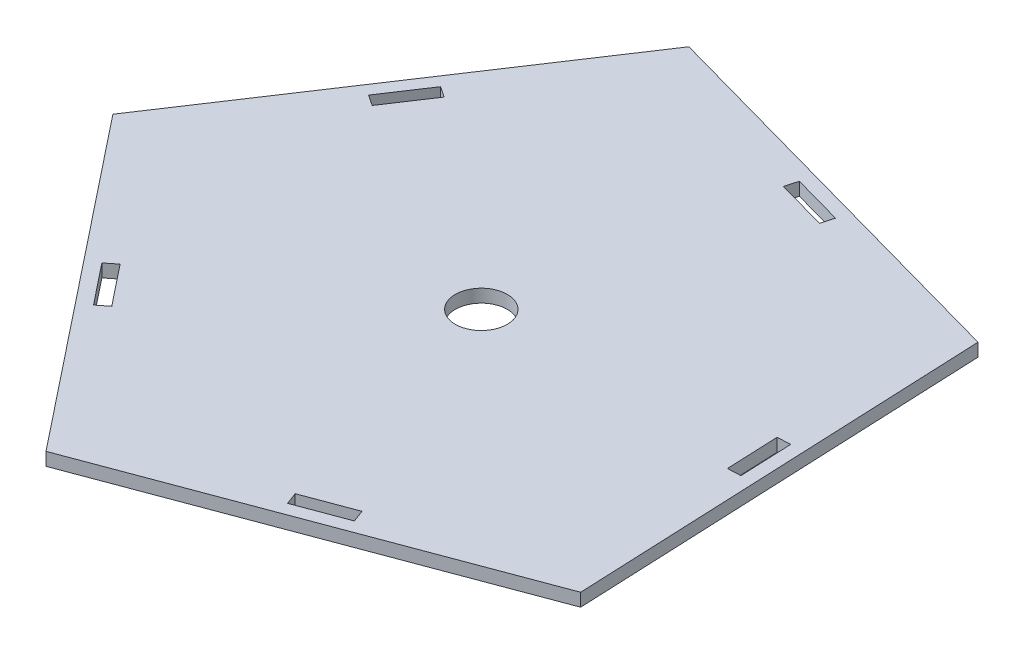
ISO-10303-21;
HEADER;
FILE_DESCRIPTION(('STEP AP214'),'2;1');
FILE_NAME('part.step','',(''),(''),'','','');
FILE_SCHEMA(('AUTOMOTIVE_DESIGN { 1 0 10303 214 1 1 1 1 }'));
ENDSEC;
DATA;
#1=APPLICATION_CONTEXT('core data for automotive mechanical design processes');
#2=APPLICATION_PROTOCOL_DEFINITION('international standard','automotive_design',2000,#1);
#3=PRODUCT_CONTEXT('',#1,'mechanical');
#4=PRODUCT('Part','Part','',(#3));
#5=PRODUCT_RELATED_PRODUCT_CATEGORY('part','',(#4));
#6=PRODUCT_DEFINITION_FORMATION('','',#4);
#7=PRODUCT_DEFINITION_CONTEXT('part definition',#1,'design');
#8=PRODUCT_DEFINITION('design','',#6,#7);
#9=PRODUCT_DEFINITION_SHAPE('','',#8);
#10=(LENGTH_UNIT() NAMED_UNIT(*) SI_UNIT(.MILLI.,.METRE.));
#11=(NAMED_UNIT(*) PLANE_ANGLE_UNIT() SI_UNIT($,.RADIAN.));
#12=(NAMED_UNIT(*) SI_UNIT($,.STERADIAN.) SOLID_ANGLE_UNIT());
#13=UNCERTAINTY_MEASURE_WITH_UNIT(LENGTH_MEASURE(1.E-05),#10,'distance_accuracy_value','');
#14=(GEOMETRIC_REPRESENTATION_CONTEXT(3) GLOBAL_UNCERTAINTY_ASSIGNED_CONTEXT((#13)) GLOBAL_UNIT_ASSIGNED_CONTEXT((#10,
#11,#12)) REPRESENTATION_CONTEXT('',''));
#15=CARTESIAN_POINT('',(0.,0.,0.));
#16=DIRECTION('',(0.,0.,1.));
#17=DIRECTION('',(1.,0.,0.));
#18=AXIS2_PLACEMENT_3D('',#15,#16,#17);
#19=CARTESIAN_POINT('',(-211.249631121891,6.35,103.874565796183));
#20=DIRECTION('',(-0.349646320054461,0.,-0.936881769954125));
#21=DIRECTION('',(-0.936881769954125,0.,0.349646320054461));
#22=AXIS2_PLACEMENT_3D('',#19,#20,#21);
#23=PLANE('',#22);
#24=DIRECTION('',(0.936881769954125,0.,-0.349646320054461));
#25=VECTOR('',#24,1.);
#26=CARTESIAN_POINT('',(-211.249631121891,0.,103.874565796183));
#27=LINE('',#26,#25);
#28=CARTESIAN_POINT('',(-211.249631121891,0.,103.874565796183));
#29=VERTEX_POINT('',#28);
#30=CARTESIAN_POINT('',(-20.8752554672127,0.,32.8264335611163));
#31=VERTEX_POINT('',#30);
#32=EDGE_CURVE('E238',#29,#31,#27,.T.);
#33=ORIENTED_EDGE('',*,*,#32,.T.);
#34=DIRECTION('',(0.,-1.,0.));
#35=VECTOR('',#34,1.);
#36=CARTESIAN_POINT('',(-20.8752554672127,6.35,32.8264335611163));
#37=LINE('',#36,#35);
#38=CARTESIAN_POINT('',(-20.8752554672127,6.35,32.8264335611163));
#39=VERTEX_POINT('',#38);
#40=EDGE_CURVE('E11',#39,#31,#37,.T.);
#41=ORIENTED_EDGE('',*,*,#40,.F.);
#42=DIRECTION('',(0.936881769954125,0.,-0.349646320054461));
#43=VECTOR('',#42,1.);
#44=CARTESIAN_POINT('',(-211.249631121891,6.35,103.874565796183));
#45=LINE('',#44,#43);
#46=CARTESIAN_POINT('',(-211.249631121891,6.35,103.874565796183));
#47=VERTEX_POINT('',#46);
#48=EDGE_CURVE('E368',#47,#39,#45,.T.);
#49=ORIENTED_EDGE('',*,*,#48,.F.);
#50=DIRECTION('',(0.,-1.,0.));
#51=VECTOR('',#50,1.);
#52=CARTESIAN_POINT('',(-211.249631121891,6.35,103.874565796183));
#53=LINE('',#52,#51);
#54=EDGE_CURVE('E380',#47,#29,#53,.T.);
#55=ORIENTED_EDGE('',*,*,#54,.T.);
#56=EDGE_LOOP('',(#33,#41,#49,#55));
#57=FACE_BOUND('',#56,.T.);
#58=ADVANCED_FACE('F32',(#57),#23,.F.);
#59=CARTESIAN_POINT('',(-20.8752554672127,6.35,32.8264335611163));
#60=DIRECTION('',(-0.999074167230498,0.,0.0430210224505114));
#61=DIRECTION('',(0.0430210224505114,0.,0.999074167230498));
#62=AXIS2_PLACEMENT_3D('',#59,#60,#61);
#63=PLANE('',#62);
#64=DIRECTION('',(-0.0430210224505114,0.,-0.999074167230498));
#65=VECTOR('',#64,1.);
#66=CARTESIAN_POINT('',(-20.8752554672127,0.,32.8264335611163));
#67=LINE('',#66,#65);
#68=CARTESIAN_POINT('',(-29.6171272291566,0.,-170.185437220121));
#69=VERTEX_POINT('',#68);
#70=EDGE_CURVE('E383',#31,#69,#67,.T.);
#71=ORIENTED_EDGE('',*,*,#70,.T.);
#72=DIRECTION('',(0.,-1.,0.));
#73=VECTOR('',#72,1.);
#74=CARTESIAN_POINT('',(-29.6171272291566,6.35,-170.185437220121));
#75=LINE('',#74,#73);
#76=CARTESIAN_POINT('',(-29.6171272291566,6.35,-170.185437220121));
#77=VERTEX_POINT('',#76);
#78=EDGE_CURVE('E39',#77,#69,#75,.T.);
#79=ORIENTED_EDGE('',*,*,#78,.F.);
#80=DIRECTION('',(-0.0430210224505114,0.,-0.999074167230498));
#81=VECTOR('',#80,1.);
#82=CARTESIAN_POINT('',(-20.8752554672127,6.35,32.8264335611163));
#83=LINE('',#82,#81);
#84=EDGE_CURVE('E371',#39,#77,#83,.T.);
#85=ORIENTED_EDGE('',*,*,#84,.F.);
#86=ORIENTED_EDGE('',*,*,#40,.T.);
#87=EDGE_LOOP('',(#71,#79,#85,#86));
#88=FACE_BOUND('',#87,.T.);
#89=ADVANCED_FACE('F421',(#88),#63,.F.);
#90=CARTESIAN_POINT('',(-29.6171272291566,6.35,-170.185437220121));
#91=DIRECTION('',(-0.267815472575983,0.,0.963470224059313));
#92=DIRECTION('',(0.963470224059313,0.,0.267815472575983));
#93=AXIS2_PLACEMENT_3D('',#90,#91,#92);
#94=PLANE('',#93);
#95=DIRECTION('',(-0.963470224059313,0.,-0.267815472575983));
#96=VECTOR('',#95,1.);
#97=CARTESIAN_POINT('',(-29.6171272291566,0.,-170.185437220121));
#98=LINE('',#97,#96);
#99=CARTESIAN_POINT('',(-225.394276758009,0.,-224.605541247561));
#100=VERTEX_POINT('',#99);
#101=EDGE_CURVE('E385',#69,#100,#98,.T.);
#102=ORIENTED_EDGE('',*,*,#101,.T.);
#103=DIRECTION('',(0.,-1.,0.));
#104=VECTOR('',#103,1.);
#105=CARTESIAN_POINT('',(-225.394276758009,6.35,-224.605541247561));
#106=LINE('',#105,#104);
#107=CARTESIAN_POINT('',(-225.394276758009,6.35,-224.605541247561));
#108=VERTEX_POINT('',#107);
#109=EDGE_CURVE('E395',#108,#100,#106,.T.);
#110=ORIENTED_EDGE('',*,*,#109,.F.);
#111=DIRECTION('',(-0.963470224059313,0.,-0.267815472575983));
#112=VECTOR('',#111,1.);
#113=CARTESIAN_POINT('',(-29.6171272291566,6.35,-170.185437220121));
#114=LINE('',#113,#112);
#115=EDGE_CURVE('E374',#77,#108,#114,.T.);
#116=ORIENTED_EDGE('',*,*,#115,.F.);
#117=ORIENTED_EDGE('',*,*,#78,.T.);
#118=EDGE_LOOP('',(#102,#110,#116,#117));
#119=FACE_BOUND('',#118,.T.);
#120=ADVANCED_FACE('F402',(#119),#94,.F.);
#121=CARTESIAN_POINT('',(-225.394276758009,6.35,-224.605541247561));
#122=DIRECTION('',(0.833555102465425,0.,0.55243632316662));
#123=DIRECTION('',(0.552436323166621,0.,-0.833555102465425));
#124=AXIS2_PLACEMENT_3D('',#121,#122,#123);
#125=PLANE('',#124);
#126=DIRECTION('',(-0.55243632316662,0.,0.833555102465425));
#127=VECTOR('',#126,1.);
#128=CARTESIAN_POINT('',(-225.394276758009,0.,-224.605541247561));
#129=LINE('',#128,#127);
#130=CARTESIAN_POINT('',(-337.649337625466,0.,-55.2271444265862));
#131=VERTEX_POINT('',#130);
#132=EDGE_CURVE('E387',#100,#131,#129,.T.);
#133=ORIENTED_EDGE('',*,*,#132,.T.);
#134=DIRECTION('',(0.,-1.,0.));
#135=VECTOR('',#134,1.);
#136=CARTESIAN_POINT('',(-337.649337625466,6.35,-55.2271444265862));
#137=LINE('',#136,#135);
#138=CARTESIAN_POINT('',(-337.649337625466,6.35,-55.2271444265862));
#139=VERTEX_POINT('',#138);
#140=EDGE_CURVE('E392',#139,#131,#137,.T.);
#141=ORIENTED_EDGE('',*,*,#140,.F.);
#142=DIRECTION('',(-0.55243632316662,0.,0.833555102465425));
#143=VECTOR('',#142,1.);
#144=CARTESIAN_POINT('',(-225.394276758009,6.35,-224.605541247561));
#145=LINE('',#144,#143);
#146=EDGE_CURVE('E376',#108,#139,#145,.T.);
#147=ORIENTED_EDGE('',*,*,#146,.F.);
#148=ORIENTED_EDGE('',*,*,#109,.T.);
#149=EDGE_LOOP('',(#133,#141,#147,#148));
#150=FACE_BOUND('',#149,.T.);
#151=ADVANCED_FACE('F411',(#150),#125,.F.);
#152=CARTESIAN_POINT('',(-337.649337625466,6.35,-55.2271444265862));
#153=DIRECTION('',(0.782980857395517,0.,-0.62204579972232));
#154=DIRECTION('',(-0.62204579972232,0.,-0.782980857395517));
#155=AXIS2_PLACEMENT_3D('',#152,#153,#154);
#156=PLANE('',#155);
#157=DIRECTION('',(0.622045799722321,0.,0.782980857395517));
#158=VECTOR('',#157,1.);
#159=CARTESIAN_POINT('',(-337.649337625466,0.,-55.2271444265862));
#160=LINE('',#159,#158);
#161=EDGE_CURVE('E372',#131,#29,#160,.T.);
#162=ORIENTED_EDGE('',*,*,#161,.T.);
#163=ORIENTED_EDGE('',*,*,#54,.F.);
#164=DIRECTION('',(0.622045799722321,0.,0.782980857395517));
#165=VECTOR('',#164,1.);
#166=CARTESIAN_POINT('',(-337.649337625466,6.35,-55.2271444265862));
#167=LINE('',#166,#165);
#168=EDGE_CURVE('E378',#139,#47,#167,.T.);
#169=ORIENTED_EDGE('',*,*,#168,.F.);
#170=ORIENTED_EDGE('',*,*,#140,.T.);
#171=EDGE_LOOP('',(#162,#163,#169,#170));
#172=FACE_BOUND('',#171,.T.);
#173=ADVANCED_FACE('F415',(#172),#156,.F.);
#174=CARTESIAN_POINT('',(0.,6.35,0.));
#175=DIRECTION('',(0.,1.,0.));
#176=DIRECTION('',(0.,0.,1.));
#177=AXIS2_PLACEMENT_3D('',#174,#175,#176);
#178=PLANE('',#177);
#179=CARTESIAN_POINT('',(-164.957125640347,6.35,-62.6634247073937));
#180=DIRECTION('',(0.,1.,0.));
#181=DIRECTION('',(0.,0.,1.));
#182=AXIS2_PLACEMENT_3D('',#179,#180,#181);
#183=CIRCLE('',#182,12.7);
#184=CARTESIAN_POINT('',(-164.957125640347,6.35,-49.9634247073937));
#185=VERTEX_POINT('',#184);
#186=EDGE_CURVE('E225',#185,#185,#183,.T.);
#187=ORIENTED_EDGE('',*,*,#186,.F.);
#188=EDGE_LOOP('',(#187));
#189=FACE_BOUND('',#188,.T.);
#190=DIRECTION('',(0.349646320054462,0.,0.936881769954124));
#191=VECTOR('',#190,1.);
#192=CARTESIAN_POINT('',(-132.401350037661,6.35,60.8926094649238));
#193=LINE('',#192,#191);
#194=CARTESIAN_POINT('',(-132.401350037661,6.35,60.8926094649238));
#195=VERTEX_POINT('',#194);
#196=CARTESIAN_POINT('',(-130.181095905315,6.35,66.8418087041325));
#197=VERTEX_POINT('',#196);
#198=EDGE_CURVE('E46',#195,#197,#193,.T.);
#199=ORIENTED_EDGE('',*,*,#198,.F.);
#200=DIRECTION('',(-0.936881769954125,0.,0.349646320054462));
#201=VECTOR('',#200,1.);
#202=CARTESIAN_POINT('',(-132.401350037661,6.35,60.8926094649238));
#203=LINE('',#202,#201);
#204=CARTESIAN_POINT('',(-108.604553080826,6.35,52.0115929355405));
#205=VERTEX_POINT('',#204);
#206=EDGE_CURVE('E219',#205,#195,#203,.T.);
#207=ORIENTED_EDGE('',*,*,#206,.F.);
#208=DIRECTION('',(-0.349646320054462,0.,-0.936881769954124));
#209=VECTOR('',#208,1.);
#210=CARTESIAN_POINT('',(-108.604553080826,6.35,52.0115929355405));
#211=LINE('',#210,#209);
#212=CARTESIAN_POINT('',(-106.38429894848,6.35,57.9607921747492));
#213=VERTEX_POINT('',#212);
#214=EDGE_CURVE('E222',#213,#205,#211,.T.);
#215=ORIENTED_EDGE('',*,*,#214,.F.);
#216=DIRECTION('',(0.936881769954125,0.,-0.34964632005446));
#217=VECTOR('',#216,1.);
#218=CARTESIAN_POINT('',(-130.181095905315,6.35,66.8418087041325));
#219=LINE('',#218,#217);
#220=EDGE_CURVE('E231',#197,#213,#219,.T.);
#221=ORIENTED_EDGE('',*,*,#220,.F.);
#222=EDGE_LOOP('',(#199,#207,#215,#221));
#223=FACE_BOUND('',#222,.T.);
#224=DIRECTION('',(-0.782980857395515,0.,0.622045799722322));
#225=VECTOR('',#224,1.);
#226=CARTESIAN_POINT('',(-277.377537585691,6.35,10.4298629676385));
#227=LINE('',#226,#225);
#228=CARTESIAN_POINT('',(-272.405609141229,6.35,6.47987213940177));
#229=VERTEX_POINT('',#228);
#230=CARTESIAN_POINT('',(-277.37753758569,6.35,10.4298629676385));
#231=VERTEX_POINT('',#230);
#232=EDGE_CURVE('E54',#229,#231,#227,.T.);
#233=ORIENTED_EDGE('',*,*,#232,.F.);
#234=DIRECTION('',(-0.62204579972232,0.,-0.782980857395517));
#235=VECTOR('',#234,1.);
#236=CARTESIAN_POINT('',(-272.405609141229,6.35,6.47987213940177));
#237=LINE('',#236,#235);
#238=CARTESIAN_POINT('',(-256.605645828282,6.35,26.3675859172479));
#239=VERTEX_POINT('',#238);
#240=EDGE_CURVE('E246',#239,#229,#237,.T.);
#241=ORIENTED_EDGE('',*,*,#240,.F.);
#242=DIRECTION('',(0.782980857395517,0.,-0.622045799722321));
#243=VECTOR('',#242,1.);
#244=CARTESIAN_POINT('',(-261.577574272744,6.35,30.3175767454846));
#245=LINE('',#244,#243);
#246=CARTESIAN_POINT('',(-261.577574272744,6.35,30.3175767454846));
#247=VERTEX_POINT('',#246);
#248=EDGE_CURVE('E261',#247,#239,#245,.T.);
#249=ORIENTED_EDGE('',*,*,#248,.F.);
#250=DIRECTION('',(0.622045799722321,0.,0.782980857395517));
#251=VECTOR('',#250,1.);
#252=CARTESIAN_POINT('',(-277.377537585691,6.35,10.4298629676385));
#253=LINE('',#252,#251);
#254=EDGE_CURVE('E257',#231,#247,#253,.T.);
#255=ORIENTED_EDGE('',*,*,#254,.F.);
#256=EDGE_LOOP('',(#233,#241,#249,#255));
#257=FACE_BOUND('',#256,.T.);
#258=DIRECTION('',(-0.55243632316662,0.,0.833555102465426));
#259=VECTOR('',#258,1.);
#260=CARTESIAN_POINT('',(-283.244673595298,6.35,-125.822222383654));
#261=LINE('',#260,#259);
#262=CARTESIAN_POINT('',(-269.212790986866,6.35,-146.994521986276));
#263=VERTEX_POINT('',#262);
#264=CARTESIAN_POINT('',(-283.244673595298,6.35,-125.822222383654));
#265=VERTEX_POINT('',#264);
#266=EDGE_CURVE('E286',#263,#265,#261,.T.);
#267=ORIENTED_EDGE('',*,*,#266,.F.);
#268=DIRECTION('',(-0.833555102465426,0.,-0.55243632316662));
#269=VECTOR('',#268,1.);
#270=CARTESIAN_POINT('',(-269.212790986866,6.35,-146.994521986276));
#271=LINE('',#270,#269);
#272=CARTESIAN_POINT('',(-263.919716086211,6.35,-143.486551334168));
#273=VERTEX_POINT('',#272);
#274=EDGE_CURVE('E276',#273,#263,#271,.T.);
#275=ORIENTED_EDGE('',*,*,#274,.F.);
#276=DIRECTION('',(0.55243632316662,0.,-0.833555102465426));
#277=VECTOR('',#276,1.);
#278=CARTESIAN_POINT('',(-277.951598694643,6.35,-122.314251731546));
#279=LINE('',#278,#277);
#280=CARTESIAN_POINT('',(-277.951598694643,6.35,-122.314251731546));
#281=VERTEX_POINT('',#280);
#282=EDGE_CURVE('E292',#281,#273,#279,.T.);
#283=ORIENTED_EDGE('',*,*,#282,.F.);
#284=DIRECTION('',(0.833555102465424,0.,0.552436323166621));
#285=VECTOR('',#284,1.);
#286=CARTESIAN_POINT('',(-283.244673595298,6.35,-125.822222383654));
#287=LINE('',#286,#285);
#288=EDGE_CURVE('E288',#265,#281,#287,.T.);
#289=ORIENTED_EDGE('',*,*,#288,.F.);
#290=EDGE_LOOP('',(#267,#275,#283,#289));
#291=FACE_BOUND('',#290,.T.);
#292=DIRECTION('',(-0.267815472575983,0.,0.963470224059313));
#293=VECTOR('',#292,1.);
#294=CARTESIAN_POINT('',(-141.442402089994,6.35,-194.678709812779));
#295=LINE('',#294,#293);
#296=CARTESIAN_POINT('',(-141.442402089994,6.35,-194.678709812779));
#297=VERTEX_POINT('',#296);
#298=CARTESIAN_POINT('',(-143.143030340851,6.35,-188.560673890003));
#299=VERTEX_POINT('',#298);
#300=EDGE_CURVE('E318',#297,#299,#295,.T.);
#301=ORIENTED_EDGE('',*,*,#300,.F.);
#302=DIRECTION('',(-0.963470224059313,0.,-0.267815472575982));
#303=VECTOR('',#302,1.);
#304=CARTESIAN_POINT('',(-141.442402089994,6.35,-194.678709812779));
#305=LINE('',#304,#303);
#306=CARTESIAN_POINT('',(-116.970258398887,6.35,-187.876196809349));
#307=VERTEX_POINT('',#306);
#308=EDGE_CURVE('E308',#307,#297,#305,.T.);
#309=ORIENTED_EDGE('',*,*,#308,.F.);
#310=DIRECTION('',(0.267815472575983,0.,-0.963470224059313));
#311=VECTOR('',#310,1.);
#312=CARTESIAN_POINT('',(-116.970258398887,6.35,-187.876196809349));
#313=LINE('',#312,#311);
#314=CARTESIAN_POINT('',(-118.670886649744,6.35,-181.758160886573));
#315=VERTEX_POINT('',#314);
#316=EDGE_CURVE('E324',#315,#307,#313,.T.);
#317=ORIENTED_EDGE('',*,*,#316,.F.);
#318=DIRECTION('',(0.963470224059313,0.,0.267815472575982));
#319=VECTOR('',#318,1.);
#320=CARTESIAN_POINT('',(-143.143030340851,6.35,-188.560673890002));
#321=LINE('',#320,#319);
#322=EDGE_CURVE('E320',#299,#315,#321,.T.);
#323=ORIENTED_EDGE('',*,*,#322,.F.);
#324=EDGE_LOOP('',(#301,#309,#317,#323));
#325=FACE_BOUND('',#324,.T.);
#326=DIRECTION('',(0.0430210224505117,0.,0.999074167230498));
#327=VECTOR('',#326,1.);
#328=CARTESIAN_POINT('',(-38.4808002571335,6.35,-80.8213767682081));
#329=LINE('',#328,#327);
#330=CARTESIAN_POINT('',(-38.4808002571335,6.35,-80.8213767682081));
#331=VERTEX_POINT('',#330);
#332=CARTESIAN_POINT('',(-37.3880662868905,6.35,-55.4448929205535));
#333=VERTEX_POINT('',#332);
#334=EDGE_CURVE('E350',#331,#333,#329,.T.);
#335=ORIENTED_EDGE('',*,*,#334,.F.);
#336=DIRECTION('',(-0.999074167230498,0.,0.0430210224505121));
#337=VECTOR('',#336,1.);
#338=CARTESIAN_POINT('',(-38.4808002571335,6.35,-80.8213767682081));
#339=LINE('',#338,#337);
#340=CARTESIAN_POINT('',(-32.1366792952198,6.35,-81.0945602607688));
#341=VERTEX_POINT('',#340);
#342=EDGE_CURVE('E340',#341,#331,#339,.T.);
#343=ORIENTED_EDGE('',*,*,#342,.F.);
#344=DIRECTION('',(-0.0430210224505117,0.,-0.999074167230498));
#345=VECTOR('',#344,1.);
#346=CARTESIAN_POINT('',(-32.1366792952198,6.35,-81.0945602607688));
#347=LINE('',#346,#345);
#348=CARTESIAN_POINT('',(-31.0439453249768,6.35,-55.7180764131142));
#349=VERTEX_POINT('',#348);
#350=EDGE_CURVE('E356',#349,#341,#347,.T.);
#351=ORIENTED_EDGE('',*,*,#350,.F.);
#352=DIRECTION('',(0.999074167230498,0.,-0.0430210224505121));
#353=VECTOR('',#352,1.);
#354=CARTESIAN_POINT('',(-37.3880662868905,6.35,-55.4448929205534));
#355=LINE('',#354,#353);
#356=EDGE_CURVE('E352',#333,#349,#355,.T.);
#357=ORIENTED_EDGE('',*,*,#356,.F.);
#358=EDGE_LOOP('',(#335,#343,#351,#357));
#359=FACE_BOUND('',#358,.T.);
#360=ORIENTED_EDGE('',*,*,#48,.T.);
#361=ORIENTED_EDGE('',*,*,#84,.T.);
#362=ORIENTED_EDGE('',*,*,#115,.T.);
#363=ORIENTED_EDGE('',*,*,#146,.T.);
#364=ORIENTED_EDGE('',*,*,#168,.T.);
#365=EDGE_LOOP('',(#360,#361,#362,#363,#364));
#366=FACE_BOUND('',#365,.T.);
#367=ADVANCED_FACE('F419',(#189,#223,#257,#291,#325,#359,#366),#178,.T.);
#368=CARTESIAN_POINT('',(0.,0.,0.));
#369=DIRECTION('',(0.,1.,0.));
#370=DIRECTION('',(0.,0.,1.));
#371=AXIS2_PLACEMENT_3D('',#368,#369,#370);
#372=PLANE('',#371);
#373=CARTESIAN_POINT('',(-164.957125640347,0.,-62.6634247073937));
#374=DIRECTION('',(0.,1.,0.));
#375=DIRECTION('',(0.,0.,1.));
#376=AXIS2_PLACEMENT_3D('',#373,#374,#375);
#377=CIRCLE('',#376,12.7);
#378=CARTESIAN_POINT('',(-164.957125640347,0.,-49.9634247073937));
#379=VERTEX_POINT('',#378);
#380=EDGE_CURVE('E353',#379,#379,#377,.T.);
#381=ORIENTED_EDGE('',*,*,#380,.T.);
#382=EDGE_LOOP('',(#381));
#383=FACE_BOUND('',#382,.T.);
#384=DIRECTION('',(-0.936881769954125,0.,0.349646320054462));
#385=VECTOR('',#384,1.);
#386=CARTESIAN_POINT('',(-132.401350037661,0.,60.8926094649238));
#387=LINE('',#386,#385);
#388=CARTESIAN_POINT('',(-108.604553080826,0.,52.0115929355405));
#389=VERTEX_POINT('',#388);
#390=CARTESIAN_POINT('',(-132.401350037661,0.,60.8926094649238));
#391=VERTEX_POINT('',#390);
#392=EDGE_CURVE('E206',#389,#391,#387,.T.);
#393=ORIENTED_EDGE('',*,*,#392,.T.);
#394=DIRECTION('',(0.349646320054462,0.,0.936881769954124));
#395=VECTOR('',#394,1.);
#396=CARTESIAN_POINT('',(-132.401350037661,0.,60.8926094649238));
#397=LINE('',#396,#395);
#398=CARTESIAN_POINT('',(-130.181095905315,0.,66.8418087041325));
#399=VERTEX_POINT('',#398);
#400=EDGE_CURVE('E200',#391,#399,#397,.T.);
#401=ORIENTED_EDGE('',*,*,#400,.T.);
#402=DIRECTION('',(0.936881769954125,0.,-0.34964632005446));
#403=VECTOR('',#402,1.);
#404=CARTESIAN_POINT('',(-130.181095905315,0.,66.8418087041325));
#405=LINE('',#404,#403);
#406=CARTESIAN_POINT('',(-106.38429894848,0.,57.9607921747492));
#407=VERTEX_POINT('',#406);
#408=EDGE_CURVE('E210',#399,#407,#405,.T.);
#409=ORIENTED_EDGE('',*,*,#408,.T.);
#410=DIRECTION('',(-0.349646320054462,0.,-0.936881769954124));
#411=VECTOR('',#410,1.);
#412=CARTESIAN_POINT('',(-108.604553080826,0.,52.0115929355405));
#413=LINE('',#412,#411);
#414=EDGE_CURVE('E214',#407,#389,#413,.T.);
#415=ORIENTED_EDGE('',*,*,#414,.T.);
#416=EDGE_LOOP('',(#393,#401,#409,#415));
#417=FACE_BOUND('',#416,.T.);
#418=DIRECTION('',(-0.62204579972232,0.,-0.782980857395517));
#419=VECTOR('',#418,1.);
#420=CARTESIAN_POINT('',(-272.405609141229,0.,6.47987213940177));
#421=LINE('',#420,#419);
#422=CARTESIAN_POINT('',(-256.605645828282,0.,26.3675859172479));
#423=VERTEX_POINT('',#422);
#424=CARTESIAN_POINT('',(-272.405609141229,0.,6.47987213940177));
#425=VERTEX_POINT('',#424);
#426=EDGE_CURVE('E252',#423,#425,#421,.T.);
#427=ORIENTED_EDGE('',*,*,#426,.T.);
#428=DIRECTION('',(-0.782980857395515,0.,0.622045799722322));
#429=VECTOR('',#428,1.);
#430=CARTESIAN_POINT('',(-277.377537585691,0.,10.4298629676385));
#431=LINE('',#430,#429);
#432=CARTESIAN_POINT('',(-277.377537585691,0.,10.4298629676385));
#433=VERTEX_POINT('',#432);
#434=EDGE_CURVE('E242',#425,#433,#431,.T.);
#435=ORIENTED_EDGE('',*,*,#434,.T.);
#436=DIRECTION('',(0.622045799722321,0.,0.782980857395517));
#437=VECTOR('',#436,1.);
#438=CARTESIAN_POINT('',(-277.377537585691,0.,10.4298629676385));
#439=LINE('',#438,#437);
#440=CARTESIAN_POINT('',(-261.577574272744,0.,30.3175767454846));
#441=VERTEX_POINT('',#440);
#442=EDGE_CURVE('E245',#433,#441,#439,.T.);
#443=ORIENTED_EDGE('',*,*,#442,.T.);
#444=DIRECTION('',(0.782980857395517,0.,-0.622045799722321));
#445=VECTOR('',#444,1.);
#446=CARTESIAN_POINT('',(-261.577574272744,0.,30.3175767454846));
#447=LINE('',#446,#445);
#448=EDGE_CURVE('E249',#441,#423,#447,.T.);
#449=ORIENTED_EDGE('',*,*,#448,.T.);
#450=EDGE_LOOP('',(#427,#435,#443,#449));
#451=FACE_BOUND('',#450,.T.);
#452=DIRECTION('',(-0.833555102465426,0.,-0.55243632316662));
#453=VECTOR('',#452,1.);
#454=CARTESIAN_POINT('',(-269.212790986866,0.,-146.994521986276));
#455=LINE('',#454,#453);
#456=CARTESIAN_POINT('',(-263.919716086211,0.,-143.486551334168));
#457=VERTEX_POINT('',#456);
#458=CARTESIAN_POINT('',(-269.212790986866,0.,-146.994521986276));
#459=VERTEX_POINT('',#458);
#460=EDGE_CURVE('E282',#457,#459,#455,.T.);
#461=ORIENTED_EDGE('',*,*,#460,.T.);
#462=DIRECTION('',(-0.55243632316662,0.,0.833555102465426));
#463=VECTOR('',#462,1.);
#464=CARTESIAN_POINT('',(-283.244673595298,0.,-125.822222383654));
#465=LINE('',#464,#463);
#466=CARTESIAN_POINT('',(-283.244673595298,0.,-125.822222383654));
#467=VERTEX_POINT('',#466);
#468=EDGE_CURVE('E272',#459,#467,#465,.T.);
#469=ORIENTED_EDGE('',*,*,#468,.T.);
#470=DIRECTION('',(0.833555102465424,0.,0.552436323166621));
#471=VECTOR('',#470,1.);
#472=CARTESIAN_POINT('',(-283.244673595298,0.,-125.822222383654));
#473=LINE('',#472,#471);
#474=CARTESIAN_POINT('',(-277.951598694643,0.,-122.314251731546));
#475=VERTEX_POINT('',#474);
#476=EDGE_CURVE('E275',#467,#475,#473,.T.);
#477=ORIENTED_EDGE('',*,*,#476,.T.);
#478=DIRECTION('',(0.55243632316662,0.,-0.833555102465426));
#479=VECTOR('',#478,1.);
#480=CARTESIAN_POINT('',(-277.951598694643,0.,-122.314251731546));
#481=LINE('',#480,#479);
#482=EDGE_CURVE('E279',#475,#457,#481,.T.);
#483=ORIENTED_EDGE('',*,*,#482,.T.);
#484=EDGE_LOOP('',(#461,#469,#477,#483));
#485=FACE_BOUND('',#484,.T.);
#486=DIRECTION('',(-0.963470224059313,0.,-0.267815472575982));
#487=VECTOR('',#486,1.);
#488=CARTESIAN_POINT('',(-141.442402089994,0.,-194.678709812779));
#489=LINE('',#488,#487);
#490=CARTESIAN_POINT('',(-116.970258398887,0.,-187.876196809349));
#491=VERTEX_POINT('',#490);
#492=CARTESIAN_POINT('',(-141.442402089994,0.,-194.678709812779));
#493=VERTEX_POINT('',#492);
#494=EDGE_CURVE('E314',#491,#493,#489,.T.);
#495=ORIENTED_EDGE('',*,*,#494,.T.);
#496=DIRECTION('',(-0.267815472575983,0.,0.963470224059313));
#497=VECTOR('',#496,1.);
#498=CARTESIAN_POINT('',(-141.442402089994,0.,-194.678709812779));
#499=LINE('',#498,#497);
#500=CARTESIAN_POINT('',(-143.143030340851,0.,-188.560673890002));
#501=VERTEX_POINT('',#500);
#502=EDGE_CURVE('E304',#493,#501,#499,.T.);
#503=ORIENTED_EDGE('',*,*,#502,.T.);
#504=DIRECTION('',(0.963470224059313,0.,0.267815472575982));
#505=VECTOR('',#504,1.);
#506=CARTESIAN_POINT('',(-143.143030340851,0.,-188.560673890002));
#507=LINE('',#506,#505);
#508=CARTESIAN_POINT('',(-118.670886649744,0.,-181.758160886573));
#509=VERTEX_POINT('',#508);
#510=EDGE_CURVE('E307',#501,#509,#507,.T.);
#511=ORIENTED_EDGE('',*,*,#510,.T.);
#512=DIRECTION('',(0.267815472575983,0.,-0.963470224059313));
#513=VECTOR('',#512,1.);
#514=CARTESIAN_POINT('',(-116.970258398887,0.,-187.876196809349));
#515=LINE('',#514,#513);
#516=EDGE_CURVE('E311',#509,#491,#515,.T.);
#517=ORIENTED_EDGE('',*,*,#516,.T.);
#518=EDGE_LOOP('',(#495,#503,#511,#517));
#519=FACE_BOUND('',#518,.T.);
#520=DIRECTION('',(-0.999074167230498,0.,0.0430210224505121));
#521=VECTOR('',#520,1.);
#522=CARTESIAN_POINT('',(-38.4808002571335,0.,-80.8213767682081));
#523=LINE('',#522,#521);
#524=CARTESIAN_POINT('',(-32.1366792952198,0.,-81.0945602607688));
#525=VERTEX_POINT('',#524);
#526=CARTESIAN_POINT('',(-38.4808002571335,0.,-80.8213767682081));
#527=VERTEX_POINT('',#526);
#528=EDGE_CURVE('E346',#525,#527,#523,.T.);
#529=ORIENTED_EDGE('',*,*,#528,.T.);
#530=DIRECTION('',(0.0430210224505117,0.,0.999074167230498));
#531=VECTOR('',#530,1.);
#532=CARTESIAN_POINT('',(-38.4808002571335,0.,-80.8213767682081));
#533=LINE('',#532,#531);
#534=CARTESIAN_POINT('',(-37.3880662868905,0.,-55.4448929205534));
#535=VERTEX_POINT('',#534);
#536=EDGE_CURVE('E336',#527,#535,#533,.T.);
#537=ORIENTED_EDGE('',*,*,#536,.T.);
#538=DIRECTION('',(0.999074167230498,0.,-0.0430210224505121));
#539=VECTOR('',#538,1.);
#540=CARTESIAN_POINT('',(-37.3880662868905,0.,-55.4448929205534));
#541=LINE('',#540,#539);
#542=CARTESIAN_POINT('',(-31.0439453249768,0.,-55.7180764131142));
#543=VERTEX_POINT('',#542);
#544=EDGE_CURVE('E339',#535,#543,#541,.T.);
#545=ORIENTED_EDGE('',*,*,#544,.T.);
#546=DIRECTION('',(-0.0430210224505117,0.,-0.999074167230498));
#547=VECTOR('',#546,1.);
#548=CARTESIAN_POINT('',(-32.1366792952198,0.,-81.0945602607688));
#549=LINE('',#548,#547);
#550=EDGE_CURVE('E343',#543,#525,#549,.T.);
#551=ORIENTED_EDGE('',*,*,#550,.T.);
#552=EDGE_LOOP('',(#529,#537,#545,#551));
#553=FACE_BOUND('',#552,.T.);
#554=ORIENTED_EDGE('',*,*,#32,.F.);
#555=ORIENTED_EDGE('',*,*,#161,.F.);
#556=ORIENTED_EDGE('',*,*,#132,.F.);
#557=ORIENTED_EDGE('',*,*,#101,.F.);
#558=ORIENTED_EDGE('',*,*,#70,.F.);
#559=EDGE_LOOP('',(#554,#555,#556,#557,#558));
#560=FACE_BOUND('',#559,.T.);
#561=ADVANCED_FACE('F216',(#383,#417,#451,#485,#519,#553,#560),#372,.F.);
#562=CARTESIAN_POINT('',(-38.4808002571335,0.,-80.8213767682081));
#563=DIRECTION('',(-0.999074167230498,0.,0.0430210224505117));
#564=DIRECTION('',(0.0430210224505117,0.,0.999074167230498));
#565=AXIS2_PLACEMENT_3D('',#562,#563,#564);
#566=PLANE('',#565);
#567=ORIENTED_EDGE('',*,*,#334,.T.);
#568=DIRECTION('',(0.,1.,0.));
#569=VECTOR('',#568,1.);
#570=CARTESIAN_POINT('',(-37.3880662868905,0.,-55.4448929205534));
#571=LINE('',#570,#569);
#572=EDGE_CURVE('E349',#535,#333,#571,.T.);
#573=ORIENTED_EDGE('',*,*,#572,.F.);
#574=ORIENTED_EDGE('',*,*,#536,.F.);
#575=DIRECTION('',(0.,1.,0.));
#576=VECTOR('',#575,1.);
#577=CARTESIAN_POINT('',(-38.4808002571335,0.,-80.8213767682081));
#578=LINE('',#577,#576);
#579=EDGE_CURVE('E321',#527,#331,#578,.T.);
#580=ORIENTED_EDGE('',*,*,#579,.T.);
#581=EDGE_LOOP('',(#567,#573,#574,#580));
#582=FACE_BOUND('',#581,.T.);
#583=ADVANCED_FACE('F438',(#582),#566,.F.);
#584=CARTESIAN_POINT('',(-38.4808002571335,0.,-80.8213767682081));
#585=DIRECTION('',(-0.0430210224505121,0.,-0.999074167230498));
#586=DIRECTION('',(-0.999074167230498,0.,0.0430210224505121));
#587=AXIS2_PLACEMENT_3D('',#584,#585,#586);
#588=PLANE('',#587);
#589=ORIENTED_EDGE('',*,*,#342,.T.);
#590=ORIENTED_EDGE('',*,*,#579,.F.);
#591=ORIENTED_EDGE('',*,*,#528,.F.);
#592=DIRECTION('',(0.,1.,0.));
#593=VECTOR('',#592,1.);
#594=CARTESIAN_POINT('',(-32.1366792952198,0.,-81.0945602607688));
#595=LINE('',#594,#593);
#596=EDGE_CURVE('E362',#525,#341,#595,.T.);
#597=ORIENTED_EDGE('',*,*,#596,.T.);
#598=EDGE_LOOP('',(#589,#590,#591,#597));
#599=FACE_BOUND('',#598,.T.);
#600=ADVANCED_FACE('F445',(#599),#588,.F.);
#601=CARTESIAN_POINT('',(-32.1366792952198,0.,-81.0945602607688));
#602=DIRECTION('',(0.999074167230498,0.,-0.0430210224505117));
#603=DIRECTION('',(-0.0430210224505117,0.,-0.999074167230498));
#604=AXIS2_PLACEMENT_3D('',#601,#602,#603);
#605=PLANE('',#604);
#606=ORIENTED_EDGE('',*,*,#350,.T.);
#607=ORIENTED_EDGE('',*,*,#596,.F.);
#608=ORIENTED_EDGE('',*,*,#550,.F.);
#609=DIRECTION('',(0.,1.,0.));
#610=VECTOR('',#609,1.);
#611=CARTESIAN_POINT('',(-31.0439453249768,0.,-55.7180764131142));
#612=LINE('',#611,#610);
#613=EDGE_CURVE('E364',#543,#349,#612,.T.);
#614=ORIENTED_EDGE('',*,*,#613,.T.);
#615=EDGE_LOOP('',(#606,#607,#608,#614));
#616=FACE_BOUND('',#615,.T.);
#617=ADVANCED_FACE('F451',(#616),#605,.F.);
#618=CARTESIAN_POINT('',(-37.3880662868905,0.,-55.4448929205534));
#619=DIRECTION('',(0.0430210224505121,0.,0.999074167230498));
#620=DIRECTION('',(0.999074167230498,0.,-0.0430210224505121));
#621=AXIS2_PLACEMENT_3D('',#618,#619,#620);
#622=PLANE('',#621);
#623=ORIENTED_EDGE('',*,*,#356,.T.);
#624=ORIENTED_EDGE('',*,*,#613,.F.);
#625=ORIENTED_EDGE('',*,*,#544,.F.);
#626=ORIENTED_EDGE('',*,*,#572,.T.);
#627=EDGE_LOOP('',(#623,#624,#625,#626));
#628=FACE_BOUND('',#627,.T.);
#629=ADVANCED_FACE('F447',(#628),#622,.F.);
#630=CARTESIAN_POINT('',(-141.442402089994,0.,-194.678709812779));
#631=DIRECTION('',(-0.963470224059313,0.,-0.267815472575983));
#632=DIRECTION('',(-0.267815472575983,0.,0.963470224059313));
#633=AXIS2_PLACEMENT_3D('',#630,#631,#632);
#634=PLANE('',#633);
#635=ORIENTED_EDGE('',*,*,#300,.T.);
#636=DIRECTION('',(0.,1.,0.));
#637=VECTOR('',#636,1.);
#638=CARTESIAN_POINT('',(-143.143030340851,0.,-188.560673890002));
#639=LINE('',#638,#637);
#640=EDGE_CURVE('E317',#501,#299,#639,.T.);
#641=ORIENTED_EDGE('',*,*,#640,.F.);
#642=ORIENTED_EDGE('',*,*,#502,.F.);
#643=DIRECTION('',(0.,1.,0.));
#644=VECTOR('',#643,1.);
#645=CARTESIAN_POINT('',(-141.442402089994,0.,-194.678709812779));
#646=LINE('',#645,#644);
#647=EDGE_CURVE('E289',#493,#297,#646,.T.);
#648=ORIENTED_EDGE('',*,*,#647,.T.);
#649=EDGE_LOOP('',(#635,#641,#642,#648));
#650=FACE_BOUND('',#649,.T.);
#651=ADVANCED_FACE('F450',(#650),#634,.F.);
#652=CARTESIAN_POINT('',(-141.442402089994,0.,-194.678709812779));
#653=DIRECTION('',(0.267815472575982,0.,-0.963470224059313));
#654=DIRECTION('',(-0.963470224059313,0.,-0.267815472575982));
#655=AXIS2_PLACEMENT_3D('',#652,#653,#654);
#656=PLANE('',#655);
#657=ORIENTED_EDGE('',*,*,#308,.T.);
#658=ORIENTED_EDGE('',*,*,#647,.F.);
#659=ORIENTED_EDGE('',*,*,#494,.F.);
#660=DIRECTION('',(0.,1.,0.));
#661=VECTOR('',#660,1.);
#662=CARTESIAN_POINT('',(-116.970258398887,0.,-187.876196809349));
#663=LINE('',#662,#661);
#664=EDGE_CURVE('E330',#491,#307,#663,.T.);
#665=ORIENTED_EDGE('',*,*,#664,.T.);
#666=EDGE_LOOP('',(#657,#658,#659,#665));
#667=FACE_BOUND('',#666,.T.);
#668=ADVANCED_FACE('F461',(#667),#656,.F.);
#669=CARTESIAN_POINT('',(-116.970258398887,0.,-187.876196809349));
#670=DIRECTION('',(0.963470224059313,0.,0.267815472575983));
#671=DIRECTION('',(0.267815472575983,0.,-0.963470224059313));
#672=AXIS2_PLACEMENT_3D('',#669,#670,#671);
#673=PLANE('',#672);
#674=ORIENTED_EDGE('',*,*,#316,.T.);
#675=ORIENTED_EDGE('',*,*,#664,.F.);
#676=ORIENTED_EDGE('',*,*,#516,.F.);
#677=DIRECTION('',(0.,1.,0.));
#678=VECTOR('',#677,1.);
#679=CARTESIAN_POINT('',(-118.670886649744,0.,-181.758160886573));
#680=LINE('',#679,#678);
#681=EDGE_CURVE('E332',#509,#315,#680,.T.);
#682=ORIENTED_EDGE('',*,*,#681,.T.);
#683=EDGE_LOOP('',(#674,#675,#676,#682));
#684=FACE_BOUND('',#683,.T.);
#685=ADVANCED_FACE('F467',(#684),#673,.F.);
#686=CARTESIAN_POINT('',(-143.143030340851,0.,-188.560673890002));
#687=DIRECTION('',(-0.267815472575982,0.,0.963470224059313));
#688=DIRECTION('',(0.963470224059313,0.,0.267815472575982));
#689=AXIS2_PLACEMENT_3D('',#686,#687,#688);
#690=PLANE('',#689);
#691=ORIENTED_EDGE('',*,*,#322,.T.);
#692=ORIENTED_EDGE('',*,*,#681,.F.);
#693=ORIENTED_EDGE('',*,*,#510,.F.);
#694=ORIENTED_EDGE('',*,*,#640,.T.);
#695=EDGE_LOOP('',(#691,#692,#693,#694));
#696=FACE_BOUND('',#695,.T.);
#697=ADVANCED_FACE('F463',(#696),#690,.F.);
#698=CARTESIAN_POINT('',(-283.244673595298,0.,-125.822222383654));
#699=DIRECTION('',(-0.833555102465425,0.,-0.55243632316662));
#700=DIRECTION('',(-0.55243632316662,0.,0.833555102465426));
#701=AXIS2_PLACEMENT_3D('',#698,#699,#700);
#702=PLANE('',#701);
#703=ORIENTED_EDGE('',*,*,#266,.T.);
#704=DIRECTION('',(0.,1.,0.));
#705=VECTOR('',#704,1.);
#706=CARTESIAN_POINT('',(-283.244673595298,0.,-125.822222383654));
#707=LINE('',#706,#705);
#708=EDGE_CURVE('E285',#467,#265,#707,.T.);
#709=ORIENTED_EDGE('',*,*,#708,.F.);
#710=ORIENTED_EDGE('',*,*,#468,.F.);
#711=DIRECTION('',(0.,1.,0.));
#712=VECTOR('',#711,1.);
#713=CARTESIAN_POINT('',(-269.212790986866,0.,-146.994521986276));
#714=LINE('',#713,#712);
#715=EDGE_CURVE('E258',#459,#263,#714,.T.);
#716=ORIENTED_EDGE('',*,*,#715,.T.);
#717=EDGE_LOOP('',(#703,#709,#710,#716));
#718=FACE_BOUND('',#717,.T.);
#719=ADVANCED_FACE('F466',(#718),#702,.F.);
#720=CARTESIAN_POINT('',(-269.212790986866,0.,-146.994521986276));
#721=DIRECTION('',(0.55243632316662,0.,-0.833555102465425));
#722=DIRECTION('',(-0.833555102465426,0.,-0.55243632316662));
#723=AXIS2_PLACEMENT_3D('',#720,#721,#722);
#724=PLANE('',#723);
#725=ORIENTED_EDGE('',*,*,#274,.T.);
#726=ORIENTED_EDGE('',*,*,#715,.F.);
#727=ORIENTED_EDGE('',*,*,#460,.F.);
#728=DIRECTION('',(0.,1.,0.));
#729=VECTOR('',#728,1.);
#730=CARTESIAN_POINT('',(-263.919716086211,0.,-143.486551334168));
#731=LINE('',#730,#729);
#732=EDGE_CURVE('E298',#457,#273,#731,.T.);
#733=ORIENTED_EDGE('',*,*,#732,.T.);
#734=EDGE_LOOP('',(#725,#726,#727,#733));
#735=FACE_BOUND('',#734,.T.);
#736=ADVANCED_FACE('F477',(#735),#724,.F.);
#737=CARTESIAN_POINT('',(-277.951598694643,0.,-122.314251731546));
#738=DIRECTION('',(0.833555102465426,0.,0.55243632316662));
#739=DIRECTION('',(0.55243632316662,0.,-0.833555102465426));
#740=AXIS2_PLACEMENT_3D('',#737,#738,#739);
#741=PLANE('',#740);
#742=ORIENTED_EDGE('',*,*,#282,.T.);
#743=ORIENTED_EDGE('',*,*,#732,.F.);
#744=ORIENTED_EDGE('',*,*,#482,.F.);
#745=DIRECTION('',(0.,1.,0.));
#746=VECTOR('',#745,1.);
#747=CARTESIAN_POINT('',(-277.951598694643,0.,-122.314251731546));
#748=LINE('',#747,#746);
#749=EDGE_CURVE('E300',#475,#281,#748,.T.);
#750=ORIENTED_EDGE('',*,*,#749,.T.);
#751=EDGE_LOOP('',(#742,#743,#744,#750));
#752=FACE_BOUND('',#751,.T.);
#753=ADVANCED_FACE('F483',(#752),#741,.F.);
#754=CARTESIAN_POINT('',(-283.244673595298,0.,-125.822222383654));
#755=DIRECTION('',(-0.552436323166621,0.,0.833555102465425));
#756=DIRECTION('',(0.833555102465425,0.,0.552436323166621));
#757=AXIS2_PLACEMENT_3D('',#754,#755,#756);
#758=PLANE('',#757);
#759=ORIENTED_EDGE('',*,*,#288,.T.);
#760=ORIENTED_EDGE('',*,*,#749,.F.);
#761=ORIENTED_EDGE('',*,*,#476,.F.);
#762=ORIENTED_EDGE('',*,*,#708,.T.);
#763=EDGE_LOOP('',(#759,#760,#761,#762));
#764=FACE_BOUND('',#763,.T.);
#765=ADVANCED_FACE('F479',(#764),#758,.F.);
#766=CARTESIAN_POINT('',(-277.377537585691,0.,10.4298629676385));
#767=DIRECTION('',(-0.622045799722322,0.,-0.782980857395515));
#768=DIRECTION('',(-0.782980857395516,0.,0.622045799722322));
#769=AXIS2_PLACEMENT_3D('',#766,#767,#768);
#770=PLANE('',#769);
#771=ORIENTED_EDGE('',*,*,#232,.T.);
#772=DIRECTION('',(0.,1.,0.));
#773=VECTOR('',#772,1.);
#774=CARTESIAN_POINT('',(-277.377537585691,0.,10.4298629676385));
#775=LINE('',#774,#773);
#776=EDGE_CURVE('E255',#433,#231,#775,.T.);
#777=ORIENTED_EDGE('',*,*,#776,.F.);
#778=ORIENTED_EDGE('',*,*,#434,.F.);
#779=DIRECTION('',(0.,1.,0.));
#780=VECTOR('',#779,1.);
#781=CARTESIAN_POINT('',(-272.405609141229,0.,6.47987213940177));
#782=LINE('',#781,#780);
#783=EDGE_CURVE('E232',#425,#229,#782,.T.);
#784=ORIENTED_EDGE('',*,*,#783,.T.);
#785=EDGE_LOOP('',(#771,#777,#778,#784));
#786=FACE_BOUND('',#785,.T.);
#787=ADVANCED_FACE('F482',(#786),#770,.F.);
#788=CARTESIAN_POINT('',(-272.405609141229,0.,6.47987213940177));
#789=DIRECTION('',(0.782980857395517,0.,-0.62204579972232));
#790=DIRECTION('',(-0.62204579972232,0.,-0.782980857395517));
#791=AXIS2_PLACEMENT_3D('',#788,#789,#790);
#792=PLANE('',#791);
#793=ORIENTED_EDGE('',*,*,#240,.T.);
#794=ORIENTED_EDGE('',*,*,#783,.F.);
#795=ORIENTED_EDGE('',*,*,#426,.F.);
#796=DIRECTION('',(0.,1.,0.));
#797=VECTOR('',#796,1.);
#798=CARTESIAN_POINT('',(-256.605645828282,0.,26.3675859172479));
#799=LINE('',#798,#797);
#800=EDGE_CURVE('E267',#423,#239,#799,.T.);
#801=ORIENTED_EDGE('',*,*,#800,.T.);
#802=EDGE_LOOP('',(#793,#794,#795,#801));
#803=FACE_BOUND('',#802,.T.);
#804=ADVANCED_FACE('F493',(#803),#792,.F.);
#805=CARTESIAN_POINT('',(-261.577574272744,0.,30.3175767454846));
#806=DIRECTION('',(0.622045799722321,0.,0.782980857395516));
#807=DIRECTION('',(0.782980857395517,0.,-0.622045799722321));
#808=AXIS2_PLACEMENT_3D('',#805,#806,#807);
#809=PLANE('',#808);
#810=ORIENTED_EDGE('',*,*,#248,.T.);
#811=ORIENTED_EDGE('',*,*,#800,.F.);
#812=ORIENTED_EDGE('',*,*,#448,.F.);
#813=DIRECTION('',(0.,1.,0.));
#814=VECTOR('',#813,1.);
#815=CARTESIAN_POINT('',(-261.577574272744,0.,30.3175767454846));
#816=LINE('',#815,#814);
#817=EDGE_CURVE('E269',#441,#247,#816,.T.);
#818=ORIENTED_EDGE('',*,*,#817,.T.);
#819=EDGE_LOOP('',(#810,#811,#812,#818));
#820=FACE_BOUND('',#819,.T.);
#821=ADVANCED_FACE('F497',(#820),#809,.F.);
#822=CARTESIAN_POINT('',(-277.377537585691,0.,10.4298629676385));
#823=DIRECTION('',(-0.782980857395517,0.,0.622045799722321));
#824=DIRECTION('',(0.622045799722321,0.,0.782980857395517));
#825=AXIS2_PLACEMENT_3D('',#822,#823,#824);
#826=PLANE('',#825);
#827=ORIENTED_EDGE('',*,*,#254,.T.);
#828=ORIENTED_EDGE('',*,*,#817,.F.);
#829=ORIENTED_EDGE('',*,*,#442,.F.);
#830=ORIENTED_EDGE('',*,*,#776,.T.);
#831=EDGE_LOOP('',(#827,#828,#829,#830));
#832=FACE_BOUND('',#831,.T.);
#833=ADVANCED_FACE('F494',(#832),#826,.F.);
#834=CARTESIAN_POINT('',(-132.401350037661,0.,60.8926094649238));
#835=DIRECTION('',(-0.936881769954124,0.,0.349646320054462));
#836=DIRECTION('',(0.349646320054462,0.,0.936881769954124));
#837=AXIS2_PLACEMENT_3D('',#834,#835,#836);
#838=PLANE('',#837);
#839=ORIENTED_EDGE('',*,*,#198,.T.);
#840=DIRECTION('',(0.,1.,0.));
#841=VECTOR('',#840,1.);
#842=CARTESIAN_POINT('',(-130.181095905315,0.,66.8418087041325));
#843=LINE('',#842,#841);
#844=EDGE_CURVE('E196',#399,#197,#843,.T.);
#845=ORIENTED_EDGE('',*,*,#844,.F.);
#846=ORIENTED_EDGE('',*,*,#400,.F.);
#847=DIRECTION('',(0.,1.,0.));
#848=VECTOR('',#847,1.);
#849=CARTESIAN_POINT('',(-132.401350037661,0.,60.8926094649238));
#850=LINE('',#849,#848);
#851=EDGE_CURVE('E236',#391,#195,#850,.T.);
#852=ORIENTED_EDGE('',*,*,#851,.T.);
#853=EDGE_LOOP('',(#839,#845,#846,#852));
#854=FACE_BOUND('',#853,.T.);
#855=ADVANCED_FACE('F198',(#854),#838,.F.);
#856=CARTESIAN_POINT('',(-132.401350037661,0.,60.8926094649238));
#857=DIRECTION('',(-0.349646320054462,0.,-0.936881769954124));
#858=DIRECTION('',(-0.936881769954125,0.,0.349646320054462));
#859=AXIS2_PLACEMENT_3D('',#856,#857,#858);
#860=PLANE('',#859);
#861=ORIENTED_EDGE('',*,*,#206,.T.);
#862=ORIENTED_EDGE('',*,*,#851,.F.);
#863=ORIENTED_EDGE('',*,*,#392,.F.);
#864=DIRECTION('',(0.,1.,0.));
#865=VECTOR('',#864,1.);
#866=CARTESIAN_POINT('',(-108.604553080826,0.,52.0115929355405));
#867=LINE('',#866,#865);
#868=EDGE_CURVE('E239',#389,#205,#867,.T.);
#869=ORIENTED_EDGE('',*,*,#868,.T.);
#870=EDGE_LOOP('',(#861,#862,#863,#869));
#871=FACE_BOUND('',#870,.T.);
#872=ADVANCED_FACE('F507',(#871),#860,.F.);
#873=CARTESIAN_POINT('',(-108.604553080826,0.,52.0115929355405));
#874=DIRECTION('',(0.936881769954124,0.,-0.349646320054462));
#875=DIRECTION('',(-0.349646320054462,0.,-0.936881769954124));
#876=AXIS2_PLACEMENT_3D('',#873,#874,#875);
#877=PLANE('',#876);
#878=ORIENTED_EDGE('',*,*,#214,.T.);
#879=ORIENTED_EDGE('',*,*,#868,.F.);
#880=ORIENTED_EDGE('',*,*,#414,.F.);
#881=DIRECTION('',(0.,1.,0.));
#882=VECTOR('',#881,1.);
#883=CARTESIAN_POINT('',(-106.38429894848,0.,57.9607921747492));
#884=LINE('',#883,#882);
#885=EDGE_CURVE('E205',#407,#213,#884,.T.);
#886=ORIENTED_EDGE('',*,*,#885,.T.);
#887=EDGE_LOOP('',(#878,#879,#880,#886));
#888=FACE_BOUND('',#887,.T.);
#889=ADVANCED_FACE('F511',(#888),#877,.F.);
#890=CARTESIAN_POINT('',(-130.181095905315,0.,66.8418087041325));
#891=DIRECTION('',(0.34964632005446,0.,0.936881769954125));
#892=DIRECTION('',(0.936881769954125,0.,-0.34964632005446));
#893=AXIS2_PLACEMENT_3D('',#890,#891,#892);
#894=PLANE('',#893);
#895=ORIENTED_EDGE('',*,*,#220,.T.);
#896=ORIENTED_EDGE('',*,*,#885,.F.);
#897=ORIENTED_EDGE('',*,*,#408,.F.);
#898=ORIENTED_EDGE('',*,*,#844,.T.);
#899=EDGE_LOOP('',(#895,#896,#897,#898));
#900=FACE_BOUND('',#899,.T.);
#901=ADVANCED_FACE('F211',(#900),#894,.F.);
#902=CARTESIAN_POINT('',(-164.957125640347,0.,-62.6634247073937));
#903=DIRECTION('',(0.,1.,0.));
#904=DIRECTION('',(0.,0.,1.));
#905=AXIS2_PLACEMENT_3D('',#902,#903,#904);
#906=CYLINDRICAL_SURFACE('',#905,12.7);
#907=ORIENTED_EDGE('',*,*,#380,.F.);
#908=EDGE_LOOP('',(#907));
#909=FACE_BOUND('',#908,.T.);
#910=ORIENTED_EDGE('',*,*,#186,.T.);
#911=EDGE_LOOP('',(#910));
#912=FACE_BOUND('',#911,.T.);
#913=ADVANCED_FACE('F510',(#909,#912),#906,.F.);
#914=CLOSED_SHELL('',(#58,#89,#120,#151,#173,#367,#561,#583,#600,#617,#629,#651,#668,#685,#697,
#719,#736,#753,#765,#787,#804,#821,#833,#855,#872,#889,#901,#913));
#915=MANIFOLD_SOLID_BREP('B2',#914);
#916=ADVANCED_BREP_SHAPE_REPRESENTATION('',(#18,#915),#14);
#917=SHAPE_DEFINITION_REPRESENTATION(#9,#916);
ENDSEC;
END-ISO-10303-21;
